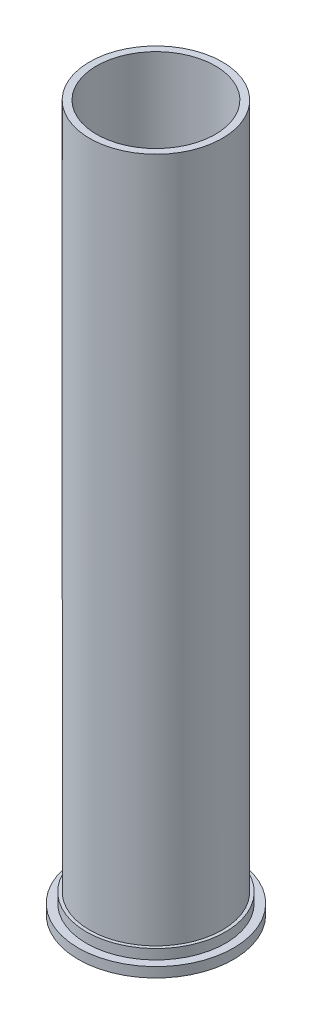
ISO-10303-21;
HEADER;
FILE_DESCRIPTION(('STEP AP214'),'2;1');
FILE_NAME('part.step','',(''),(''),'','','');
FILE_SCHEMA(('AUTOMOTIVE_DESIGN { 1 0 10303 214 1 1 1 1 }'));
ENDSEC;
DATA;
#1=APPLICATION_CONTEXT('core data for automotive mechanical design processes');
#2=APPLICATION_PROTOCOL_DEFINITION('international standard','automotive_design',2000,#1);
#3=PRODUCT_CONTEXT('',#1,'mechanical');
#4=PRODUCT('Part','Part','',(#3));
#5=PRODUCT_RELATED_PRODUCT_CATEGORY('part','',(#4));
#6=PRODUCT_DEFINITION_FORMATION('','',#4);
#7=PRODUCT_DEFINITION_CONTEXT('part definition',#1,'design');
#8=PRODUCT_DEFINITION('design','',#6,#7);
#9=PRODUCT_DEFINITION_SHAPE('','',#8);
#10=(LENGTH_UNIT() NAMED_UNIT(*) SI_UNIT(.MILLI.,.METRE.));
#11=(NAMED_UNIT(*) PLANE_ANGLE_UNIT() SI_UNIT($,.RADIAN.));
#12=(NAMED_UNIT(*) SI_UNIT($,.STERADIAN.) SOLID_ANGLE_UNIT());
#13=UNCERTAINTY_MEASURE_WITH_UNIT(LENGTH_MEASURE(1.E-05),#10,'distance_accuracy_value','');
#14=(GEOMETRIC_REPRESENTATION_CONTEXT(3) GLOBAL_UNCERTAINTY_ASSIGNED_CONTEXT((#13)) GLOBAL_UNIT_ASSIGNED_CONTEXT((#10,
#11,#12)) REPRESENTATION_CONTEXT('',''));
#15=CARTESIAN_POINT('',(0.,0.,0.));
#16=DIRECTION('',(0.,0.,1.));
#17=DIRECTION('',(1.,0.,0.));
#18=AXIS2_PLACEMENT_3D('',#15,#16,#17);
#19=CARTESIAN_POINT('',(0.,2.14,0.));
#20=DIRECTION('',(0.,1.,0.));
#21=DIRECTION('',(0.,0.,1.));
#22=AXIS2_PLACEMENT_3D('',#19,#20,#21);
#23=PLANE('',#22);
#24=CARTESIAN_POINT('',(0.,2.14,0.));
#25=DIRECTION('',(0.,1.,0.));
#26=DIRECTION('',(0.,0.,1.));
#27=AXIS2_PLACEMENT_3D('',#24,#25,#26);
#28=CIRCLE('',#27,15.);
#29=CARTESIAN_POINT('',(0.,2.14,15.));
#30=VERTEX_POINT('',#29);
#31=EDGE_CURVE('E50',#30,#30,#28,.T.);
#32=ORIENTED_EDGE('',*,*,#31,.F.);
#33=EDGE_LOOP('',(#32));
#34=FACE_BOUND('',#33,.T.);
#35=CARTESIAN_POINT('',(0.,2.14,0.));
#36=DIRECTION('',(0.,1.,0.));
#37=DIRECTION('',(0.,0.,1.));
#38=AXIS2_PLACEMENT_3D('',#35,#36,#37);
#39=CIRCLE('',#38,16.75);
#40=CARTESIAN_POINT('',(0.,2.14,16.75));
#41=VERTEX_POINT('',#40);
#42=EDGE_CURVE('E52',#41,#41,#39,.T.);
#43=ORIENTED_EDGE('',*,*,#42,.T.);
#44=EDGE_LOOP('',(#43));
#45=FACE_BOUND('',#44,.T.);
#46=ADVANCED_FACE('F35',(#34,#45),#23,.T.);
#47=CARTESIAN_POINT('',(0.,2.14,0.));
#48=DIRECTION('',(0.,-1.,0.));
#49=DIRECTION('',(0.,0.,-1.));
#50=AXIS2_PLACEMENT_3D('',#47,#48,#49);
#51=CYLINDRICAL_SURFACE('',#50,16.75);
#52=ORIENTED_EDGE('',*,*,#42,.F.);
#53=EDGE_LOOP('',(#52));
#54=FACE_BOUND('',#53,.T.);
#55=CARTESIAN_POINT('',(0.,0.,0.));
#56=DIRECTION('',(0.,1.,0.));
#57=DIRECTION('',(0.,0.,1.));
#58=AXIS2_PLACEMENT_3D('',#55,#56,#57);
#59=CIRCLE('',#58,16.75);
#60=CARTESIAN_POINT('',(0.,0.,16.75));
#61=VERTEX_POINT('',#60);
#62=EDGE_CURVE('E56',#61,#61,#59,.T.);
#63=ORIENTED_EDGE('',*,*,#62,.T.);
#64=EDGE_LOOP('',(#63));
#65=FACE_BOUND('',#64,.T.);
#66=ADVANCED_FACE('F82',(#54,#65),#51,.T.);
#67=CARTESIAN_POINT('',(12.815,0.,0.));
#68=DIRECTION('',(0.,-1.,0.));
#69=DIRECTION('',(0.,0.,-1.));
#70=AXIS2_PLACEMENT_3D('',#67,#68,#69);
#71=PLANE('',#70);
#72=ORIENTED_EDGE('',*,*,#62,.F.);
#73=EDGE_LOOP('',(#72));
#74=FACE_BOUND('',#73,.T.);
#75=ADVANCED_FACE('F88',(#74),#71,.T.);
#76=CARTESIAN_POINT('',(0.,4.28,0.));
#77=DIRECTION('',(0.,-1.,0.));
#78=DIRECTION('',(0.,0.,-1.));
#79=AXIS2_PLACEMENT_3D('',#76,#77,#78);
#80=CYLINDRICAL_SURFACE('',#79,15.);
#81=CARTESIAN_POINT('',(0.,4.28,0.));
#82=DIRECTION('',(0.,1.,0.));
#83=DIRECTION('',(0.,0.,1.));
#84=AXIS2_PLACEMENT_3D('',#81,#82,#83);
#85=CIRCLE('',#84,15.);
#86=CARTESIAN_POINT('',(0.,4.28,15.));
#87=VERTEX_POINT('',#86);
#88=EDGE_CURVE('E59',#87,#87,#85,.T.);
#89=ORIENTED_EDGE('',*,*,#88,.F.);
#90=EDGE_LOOP('',(#89));
#91=FACE_BOUND('',#90,.T.);
#92=ORIENTED_EDGE('',*,*,#31,.T.);
#93=EDGE_LOOP('',(#92));
#94=FACE_BOUND('',#93,.T.);
#95=ADVANCED_FACE('F93',(#91,#94),#80,.T.);
#96=CARTESIAN_POINT('',(0.,4.28,0.));
#97=DIRECTION('',(0.,1.,0.));
#98=DIRECTION('',(0.,0.,1.));
#99=AXIS2_PLACEMENT_3D('',#96,#97,#98);
#100=PLANE('',#99);
#101=CARTESIAN_POINT('',(0.,4.28,0.));
#102=DIRECTION('',(0.,1.,0.));
#103=DIRECTION('',(0.,0.,1.));
#104=AXIS2_PLACEMENT_3D('',#101,#102,#103);
#105=CIRCLE('',#104,14.315);
#106=CARTESIAN_POINT('',(0.,4.28,14.315));
#107=VERTEX_POINT('',#106);
#108=EDGE_CURVE('E39',#107,#107,#105,.F.);
#109=ORIENTED_EDGE('',*,*,#108,.T.);
#110=EDGE_LOOP('',(#109));
#111=FACE_BOUND('',#110,.T.);
#112=ORIENTED_EDGE('',*,*,#88,.T.);
#113=EDGE_LOOP('',(#112));
#114=FACE_BOUND('',#113,.T.);
#115=ADVANCED_FACE('F79',(#111,#114),#100,.T.);
#116=CARTESIAN_POINT('',(0.,0.,0.));
#117=DIRECTION('',(0.,-1.,0.));
#118=DIRECTION('',(0.,0.,-1.));
#119=AXIS2_PLACEMENT_3D('',#116,#117,#118);
#120=CYLINDRICAL_SURFACE('',#119,12.815);
#121=CARTESIAN_POINT('',(0.,4.28,0.));
#122=DIRECTION('',(0.,1.,0.));
#123=DIRECTION('',(0.,0.,1.));
#124=AXIS2_PLACEMENT_3D('',#121,#122,#123);
#125=CIRCLE('',#124,12.815);
#126=CARTESIAN_POINT('',(0.,4.28,12.815));
#127=VERTEX_POINT('',#126);
#128=EDGE_CURVE('E10',#127,#127,#125,.T.);
#129=ORIENTED_EDGE('',*,*,#128,.F.);
#130=EDGE_LOOP('',(#129));
#131=FACE_BOUND('',#130,.T.);
#132=CARTESIAN_POINT('',(0.,152.24,0.));
#133=DIRECTION('',(0.,-1.,0.));
#134=DIRECTION('',(0.,0.,-1.));
#135=AXIS2_PLACEMENT_3D('',#132,#133,#134);
#136=CIRCLE('',#135,12.815);
#137=CARTESIAN_POINT('',(0.,152.24,-12.815));
#138=VERTEX_POINT('',#137);
#139=EDGE_CURVE('E55',#138,#138,#136,.T.);
#140=ORIENTED_EDGE('',*,*,#139,.F.);
#141=EDGE_LOOP('',(#140));
#142=FACE_BOUND('',#141,.T.);
#143=ADVANCED_FACE('F37',(#131,#142),#120,.F.);
#144=CARTESIAN_POINT('',(14.315,152.24,0.));
#145=DIRECTION('',(0.,1.,0.));
#146=DIRECTION('',(0.,0.,1.));
#147=AXIS2_PLACEMENT_3D('',#144,#145,#146);
#148=PLANE('',#147);
#149=ORIENTED_EDGE('',*,*,#139,.T.);
#150=EDGE_LOOP('',(#149));
#151=FACE_BOUND('',#150,.T.);
#152=CARTESIAN_POINT('',(0.,152.24,0.));
#153=DIRECTION('',(0.,-1.,0.));
#154=DIRECTION('',(0.,0.,-1.));
#155=AXIS2_PLACEMENT_3D('',#152,#153,#154);
#156=CIRCLE('',#155,14.315);
#157=CARTESIAN_POINT('',(0.,152.24,-14.315));
#158=VERTEX_POINT('',#157);
#159=EDGE_CURVE('E47',#158,#158,#156,.T.);
#160=ORIENTED_EDGE('',*,*,#159,.F.);
#161=EDGE_LOOP('',(#160));
#162=FACE_BOUND('',#161,.T.);
#163=ADVANCED_FACE('F66',(#151,#162),#148,.T.);
#164=CARTESIAN_POINT('',(0.,0.,0.));
#165=DIRECTION('',(0.,-1.,0.));
#166=DIRECTION('',(0.,0.,-1.));
#167=AXIS2_PLACEMENT_3D('',#164,#165,#166);
#168=CYLINDRICAL_SURFACE('',#167,14.315);
#169=ORIENTED_EDGE('',*,*,#108,.F.);
#170=EDGE_LOOP('',(#169));
#171=FACE_BOUND('',#170,.T.);
#172=ORIENTED_EDGE('',*,*,#159,.T.);
#173=EDGE_LOOP('',(#172));
#174=FACE_BOUND('',#173,.T.);
#175=ADVANCED_FACE('F64',(#171,#174),#168,.T.);
#176=ORIENTED_EDGE('',*,*,#128,.T.);
#177=EDGE_LOOP('',(#176));
#178=FACE_BOUND('',#177,.T.);
#179=ADVANCED_FACE('F75',(#178),#100,.T.);
#180=CLOSED_SHELL('',(#46,#66,#75,#95,#115,#143,#163,#175,#179));
#181=MANIFOLD_SOLID_BREP('B2',#180);
#182=ADVANCED_BREP_SHAPE_REPRESENTATION('',(#18,#181),#14);
#183=SHAPE_DEFINITION_REPRESENTATION(#9,#182);
ENDSEC;
END-ISO-10303-21;
